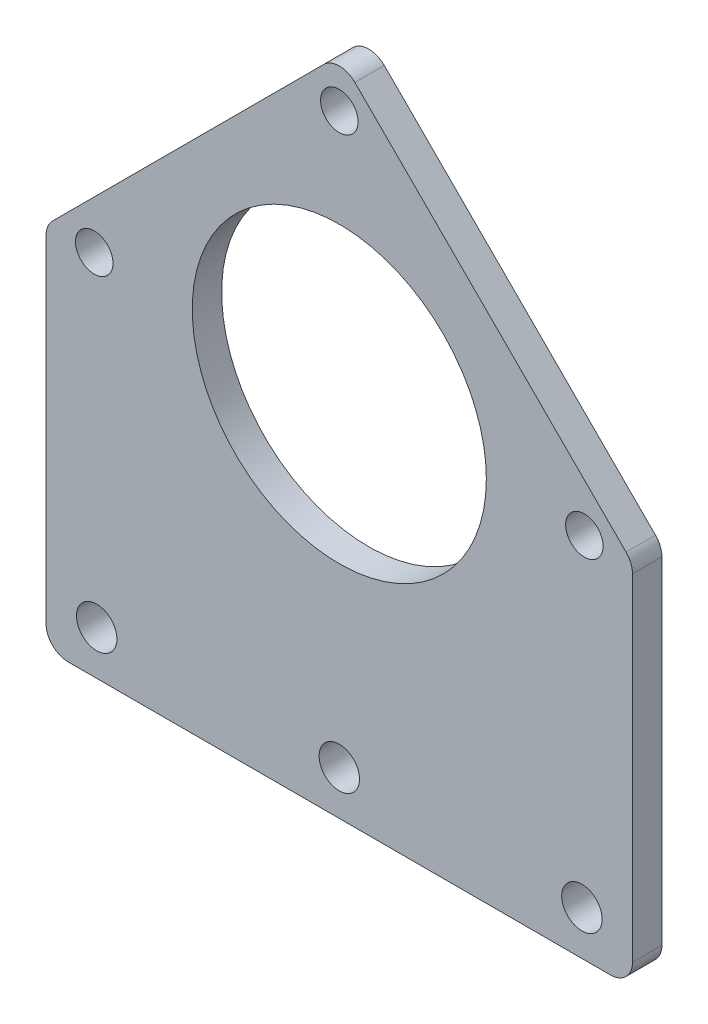
ISO-10303-21;
HEADER;
FILE_DESCRIPTION(('STEP AP214'),'2;1');
FILE_NAME('part.step','',(''),(''),'','','');
FILE_SCHEMA(('AUTOMOTIVE_DESIGN { 1 0 10303 214 1 1 1 1 }'));
ENDSEC;
DATA;
#1=APPLICATION_CONTEXT('core data for automotive mechanical design processes');
#2=APPLICATION_PROTOCOL_DEFINITION('international standard','automotive_design',2000,#1);
#3=PRODUCT_CONTEXT('',#1,'mechanical');
#4=PRODUCT('Part','Part','',(#3));
#5=PRODUCT_RELATED_PRODUCT_CATEGORY('part','',(#4));
#6=PRODUCT_DEFINITION_FORMATION('','',#4);
#7=PRODUCT_DEFINITION_CONTEXT('part definition',#1,'design');
#8=PRODUCT_DEFINITION('design','',#6,#7);
#9=PRODUCT_DEFINITION_SHAPE('','',#8);
#10=(LENGTH_UNIT() NAMED_UNIT(*) SI_UNIT(.MILLI.,.METRE.));
#11=(NAMED_UNIT(*) PLANE_ANGLE_UNIT() SI_UNIT($,.RADIAN.));
#12=(NAMED_UNIT(*) SI_UNIT($,.STERADIAN.) SOLID_ANGLE_UNIT());
#13=UNCERTAINTY_MEASURE_WITH_UNIT(LENGTH_MEASURE(1.E-05),#10,'distance_accuracy_value','');
#14=(GEOMETRIC_REPRESENTATION_CONTEXT(3) GLOBAL_UNCERTAINTY_ASSIGNED_CONTEXT((#13)) GLOBAL_UNIT_ASSIGNED_CONTEXT((#10,
#11,#12)) REPRESENTATION_CONTEXT('',''));
#15=CARTESIAN_POINT('',(0.,0.,0.));
#16=DIRECTION('',(0.,0.,1.));
#17=DIRECTION('',(1.,0.,0.));
#18=AXIS2_PLACEMENT_3D('',#15,#16,#17);
#19=CARTESIAN_POINT('',(0.,0.,4.));
#20=DIRECTION('',(0.,0.,1.));
#21=DIRECTION('',(1.,0.,0.));
#22=AXIS2_PLACEMENT_3D('',#19,#20,#21);
#23=PLANE('',#22);
#24=CARTESIAN_POINT('',(33.3330136651338,0.,4.));
#25=DIRECTION('',(0.,0.,1.));
#26=DIRECTION('',(1.,0.,0.));
#27=AXIS2_PLACEMENT_3D('',#24,#25,#26);
#28=CIRCLE('',#27,2.55);
#29=CARTESIAN_POINT('',(35.8830136651338,0.,4.));
#30=VERTEX_POINT('',#29);
#31=EDGE_CURVE('E236',#30,#30,#28,.T.);
#32=ORIENTED_EDGE('',*,*,#31,.F.);
#33=EDGE_LOOP('',(#32));
#34=FACE_BOUND('',#33,.T.);
#35=CARTESIAN_POINT('',(33.,-44.,4.));
#36=DIRECTION('',(0.,0.,1.));
#37=DIRECTION('',(1.,0.,0.));
#38=AXIS2_PLACEMENT_3D('',#35,#36,#37);
#39=CIRCLE('',#38,2.75);
#40=CARTESIAN_POINT('',(35.75,-44.,4.));
#41=VERTEX_POINT('',#40);
#42=EDGE_CURVE('E224',#41,#41,#39,.T.);
#43=ORIENTED_EDGE('',*,*,#42,.F.);
#44=EDGE_LOOP('',(#43));
#45=FACE_BOUND('',#44,.T.);
#46=CARTESIAN_POINT('',(0.,-44.,4.));
#47=DIRECTION('',(0.,0.,1.));
#48=DIRECTION('',(1.,0.,0.));
#49=AXIS2_PLACEMENT_3D('',#46,#47,#48);
#50=CIRCLE('',#49,2.75);
#51=CARTESIAN_POINT('',(2.75,-44.,4.));
#52=VERTEX_POINT('',#51);
#53=EDGE_CURVE('E213',#52,#52,#50,.T.);
#54=ORIENTED_EDGE('',*,*,#53,.F.);
#55=EDGE_LOOP('',(#54));
#56=FACE_BOUND('',#55,.T.);
#57=DIRECTION('',(1.,0.,0.));
#58=VECTOR('',#57,1.);
#59=CARTESIAN_POINT('',(-39.8808224589212,-50.,4.));
#60=LINE('',#59,#58);
#61=CARTESIAN_POINT('',(-36.8808224589212,-50.,4.));
#62=VERTEX_POINT('',#61);
#63=CARTESIAN_POINT('',(36.8808224589212,-50.,4.));
#64=VERTEX_POINT('',#63);
#65=EDGE_CURVE('E197',#62,#64,#60,.T.);
#66=ORIENTED_EDGE('',*,*,#65,.T.);
#67=CARTESIAN_POINT('',(36.8808224589212,-47.,4.));
#68=DIRECTION('',(0.,0.,1.));
#69=DIRECTION('',(1.,0.,0.));
#70=AXIS2_PLACEMENT_3D('',#67,#68,#69);
#71=CIRCLE('',#70,3.);
#72=CARTESIAN_POINT('',(39.8808224589212,-47.,4.));
#73=VERTEX_POINT('',#72);
#74=EDGE_CURVE('E169',#64,#73,#71,.T.);
#75=ORIENTED_EDGE('',*,*,#74,.T.);
#76=DIRECTION('',(0.,1.,0.));
#77=VECTOR('',#76,1.);
#78=CARTESIAN_POINT('',(39.8808224589212,-50.,4.));
#79=LINE('',#78,#77);
#80=CARTESIAN_POINT('',(39.8808224589212,-1.2426406871193,4.));
#81=VERTEX_POINT('',#80);
#82=EDGE_CURVE('E132',#73,#81,#79,.T.);
#83=ORIENTED_EDGE('',*,*,#82,.T.);
#84=CARTESIAN_POINT('',(36.8808224589212,-1.2426406871193,4.));
#85=DIRECTION('',(0.,0.,1.));
#86=DIRECTION('',(1.,0.,0.));
#87=AXIS2_PLACEMENT_3D('',#84,#85,#86);
#88=CIRCLE('',#87,3.);
#89=CARTESIAN_POINT('',(39.0021428024809,0.878679656440326,4.));
#90=VERTEX_POINT('',#89);
#91=EDGE_CURVE('E165',#81,#90,#88,.T.);
#92=ORIENTED_EDGE('',*,*,#91,.T.);
#93=DIRECTION('',(-0.707106781186546,0.707106781186549,0.));
#94=VECTOR('',#93,1.);
#95=CARTESIAN_POINT('',(0.,39.8808224589213,4.));
#96=LINE('',#95,#94);
#97=CARTESIAN_POINT('',(2.12132034355964,37.7595021153617,4.));
#98=VERTEX_POINT('',#97);
#99=EDGE_CURVE('E206',#90,#98,#96,.T.);
#100=ORIENTED_EDGE('',*,*,#99,.T.);
#101=CARTESIAN_POINT('',(0.,35.638181771802,4.));
#102=DIRECTION('',(0.,0.,1.));
#103=DIRECTION('',(1.,0.,0.));
#104=AXIS2_PLACEMENT_3D('',#101,#102,#103);
#105=CIRCLE('',#104,3.);
#106=CARTESIAN_POINT('',(-2.12132034355965,37.7595021153617,4.));
#107=VERTEX_POINT('',#106);
#108=EDGE_CURVE('E55',#98,#107,#105,.T.);
#109=ORIENTED_EDGE('',*,*,#108,.T.);
#110=DIRECTION('',(-0.707106781186546,-0.707106781186549,0.));
#111=VECTOR('',#110,1.);
#112=CARTESIAN_POINT('',(-39.8808224589212,0.,4.));
#113=LINE('',#112,#111);
#114=CARTESIAN_POINT('',(-39.0021428024809,0.878679656440357,4.));
#115=VERTEX_POINT('',#114);
#116=EDGE_CURVE('E152',#107,#115,#113,.T.);
#117=ORIENTED_EDGE('',*,*,#116,.T.);
#118=CARTESIAN_POINT('',(-36.8808224589212,-1.24264068711928,4.));
#119=DIRECTION('',(0.,0.,1.));
#120=DIRECTION('',(1.,0.,0.));
#121=AXIS2_PLACEMENT_3D('',#118,#119,#120);
#122=CIRCLE('',#121,3.);
#123=CARTESIAN_POINT('',(-39.8808224589212,-1.24264068711928,4.));
#124=VERTEX_POINT('',#123);
#125=EDGE_CURVE('E163',#115,#124,#122,.T.);
#126=ORIENTED_EDGE('',*,*,#125,.T.);
#127=DIRECTION('',(0.,-1.,0.));
#128=VECTOR('',#127,1.);
#129=CARTESIAN_POINT('',(-39.8808224589212,0.,4.));
#130=LINE('',#129,#128);
#131=CARTESIAN_POINT('',(-39.8808224589212,-47.,4.));
#132=VERTEX_POINT('',#131);
#133=EDGE_CURVE('E151',#124,#132,#130,.T.);
#134=ORIENTED_EDGE('',*,*,#133,.T.);
#135=CARTESIAN_POINT('',(-36.8808224589212,-47.,4.));
#136=DIRECTION('',(0.,0.,1.));
#137=DIRECTION('',(1.,0.,0.));
#138=AXIS2_PLACEMENT_3D('',#135,#136,#137);
#139=CIRCLE('',#138,3.);
#140=EDGE_CURVE('E167',#132,#62,#139,.T.);
#141=ORIENTED_EDGE('',*,*,#140,.T.);
#142=EDGE_LOOP('',(#66,#75,#83,#92,#100,#109,#117,#126,#134,#141));
#143=FACE_BOUND('',#142,.T.);
#144=CARTESIAN_POINT('',(-33.,-44.,4.));
#145=DIRECTION('',(0.,0.,1.));
#146=DIRECTION('',(1.,0.,0.));
#147=AXIS2_PLACEMENT_3D('',#144,#145,#146);
#148=CIRCLE('',#147,2.75);
#149=CARTESIAN_POINT('',(-30.25,-44.,4.));
#150=VERTEX_POINT('',#149);
#151=EDGE_CURVE('E208',#150,#150,#148,.T.);
#152=ORIENTED_EDGE('',*,*,#151,.F.);
#153=EDGE_LOOP('',(#152));
#154=FACE_BOUND('',#153,.T.);
#155=CARTESIAN_POINT('',(-33.3330136651338,0.,4.));
#156=DIRECTION('',(0.,0.,1.));
#157=DIRECTION('',(1.,0.,0.));
#158=AXIS2_PLACEMENT_3D('',#155,#156,#157);
#159=CIRCLE('',#158,2.55);
#160=CARTESIAN_POINT('',(-30.7830136651338,0.,4.));
#161=VERTEX_POINT('',#160);
#162=EDGE_CURVE('E218',#161,#161,#159,.T.);
#163=ORIENTED_EDGE('',*,*,#162,.F.);
#164=EDGE_LOOP('',(#163));
#165=FACE_BOUND('',#164,.T.);
#166=CARTESIAN_POINT('',(0.,33.3330136651338,4.));
#167=DIRECTION('',(0.,0.,1.));
#168=DIRECTION('',(1.,0.,0.));
#169=AXIS2_PLACEMENT_3D('',#166,#167,#168);
#170=CIRCLE('',#169,2.55);
#171=CARTESIAN_POINT('',(2.55,33.3330136651338,4.));
#172=VERTEX_POINT('',#171);
#173=EDGE_CURVE('E230',#172,#172,#170,.T.);
#174=ORIENTED_EDGE('',*,*,#173,.F.);
#175=EDGE_LOOP('',(#174));
#176=FACE_BOUND('',#175,.T.);
#177=CARTESIAN_POINT('',(0.,0.,4.));
#178=DIRECTION('',(0.,0.,1.));
#179=DIRECTION('',(1.,0.,0.));
#180=AXIS2_PLACEMENT_3D('',#177,#178,#179);
#181=CIRCLE('',#180,20.);
#182=CARTESIAN_POINT('',(20.,0.,4.));
#183=VERTEX_POINT('',#182);
#184=EDGE_CURVE('E242',#183,#183,#181,.T.);
#185=ORIENTED_EDGE('',*,*,#184,.F.);
#186=EDGE_LOOP('',(#185));
#187=FACE_BOUND('',#186,.T.);
#188=ADVANCED_FACE('F35',(#34,#45,#56,#143,#154,#165,#176,#187),#23,.T.);
#189=CARTESIAN_POINT('',(0.,0.,0.));
#190=DIRECTION('',(0.,0.,1.));
#191=DIRECTION('',(1.,0.,0.));
#192=AXIS2_PLACEMENT_3D('',#189,#190,#191);
#193=PLANE('',#192);
#194=DIRECTION('',(0.,1.,0.));
#195=VECTOR('',#194,1.);
#196=CARTESIAN_POINT('',(39.8808224589212,-50.,0.));
#197=LINE('',#196,#195);
#198=CARTESIAN_POINT('',(39.8808224589212,-47.,0.));
#199=VERTEX_POINT('',#198);
#200=CARTESIAN_POINT('',(39.8808224589212,-1.2426406871193,0.));
#201=VERTEX_POINT('',#200);
#202=EDGE_CURVE('E129',#199,#201,#197,.T.);
#203=ORIENTED_EDGE('',*,*,#202,.F.);
#204=CARTESIAN_POINT('',(36.8808224589212,-47.,0.));
#205=DIRECTION('',(0.,0.,1.));
#206=DIRECTION('',(1.,0.,0.));
#207=AXIS2_PLACEMENT_3D('',#204,#205,#206);
#208=CIRCLE('',#207,3.);
#209=CARTESIAN_POINT('',(36.8808224589212,-50.,0.));
#210=VERTEX_POINT('',#209);
#211=EDGE_CURVE('E112',#199,#210,#208,.F.);
#212=ORIENTED_EDGE('',*,*,#211,.T.);
#213=DIRECTION('',(1.,0.,0.));
#214=VECTOR('',#213,1.);
#215=CARTESIAN_POINT('',(-39.8808224589212,-50.,0.));
#216=LINE('',#215,#214);
#217=CARTESIAN_POINT('',(-36.8808224589212,-50.,0.));
#218=VERTEX_POINT('',#217);
#219=EDGE_CURVE('E141',#218,#210,#216,.T.);
#220=ORIENTED_EDGE('',*,*,#219,.F.);
#221=CARTESIAN_POINT('',(-36.8808224589212,-47.,0.));
#222=DIRECTION('',(0.,0.,1.));
#223=DIRECTION('',(1.,0.,0.));
#224=AXIS2_PLACEMENT_3D('',#221,#222,#223);
#225=CIRCLE('',#224,3.);
#226=CARTESIAN_POINT('',(-39.8808224589212,-47.,0.));
#227=VERTEX_POINT('',#226);
#228=EDGE_CURVE('E123',#218,#227,#225,.F.);
#229=ORIENTED_EDGE('',*,*,#228,.T.);
#230=DIRECTION('',(0.,-1.,0.));
#231=VECTOR('',#230,1.);
#232=CARTESIAN_POINT('',(-39.8808224589212,0.,0.));
#233=LINE('',#232,#231);
#234=CARTESIAN_POINT('',(-39.8808224589212,-1.24264068711928,0.));
#235=VERTEX_POINT('',#234);
#236=EDGE_CURVE('E146',#235,#227,#233,.T.);
#237=ORIENTED_EDGE('',*,*,#236,.F.);
#238=CARTESIAN_POINT('',(-36.8808224589212,-1.24264068711928,0.));
#239=DIRECTION('',(0.,0.,1.));
#240=DIRECTION('',(1.,0.,0.));
#241=AXIS2_PLACEMENT_3D('',#238,#239,#240);
#242=CIRCLE('',#241,3.);
#243=CARTESIAN_POINT('',(-39.0021428024809,0.878679656440357,0.));
#244=VERTEX_POINT('',#243);
#245=EDGE_CURVE('E155',#235,#244,#242,.F.);
#246=ORIENTED_EDGE('',*,*,#245,.T.);
#247=DIRECTION('',(-0.707106781186546,-0.707106781186549,0.));
#248=VECTOR('',#247,1.);
#249=CARTESIAN_POINT('',(-39.8808224589212,0.,0.));
#250=LINE('',#249,#248);
#251=CARTESIAN_POINT('',(-2.12132034355965,37.7595021153617,0.));
#252=VERTEX_POINT('',#251);
#253=EDGE_CURVE('E144',#252,#244,#250,.T.);
#254=ORIENTED_EDGE('',*,*,#253,.F.);
#255=CARTESIAN_POINT('',(0.,35.638181771802,0.));
#256=DIRECTION('',(0.,0.,1.));
#257=DIRECTION('',(1.,0.,0.));
#258=AXIS2_PLACEMENT_3D('',#255,#256,#257);
#259=CIRCLE('',#258,3.);
#260=CARTESIAN_POINT('',(2.12132034355964,37.7595021153617,0.));
#261=VERTEX_POINT('',#260);
#262=EDGE_CURVE('E133',#252,#261,#259,.F.);
#263=ORIENTED_EDGE('',*,*,#262,.T.);
#264=DIRECTION('',(-0.707106781186546,0.707106781186549,0.));
#265=VECTOR('',#264,1.);
#266=CARTESIAN_POINT('',(0.,39.8808224589213,0.));
#267=LINE('',#266,#265);
#268=CARTESIAN_POINT('',(39.0021428024809,0.878679656440326,0.));
#269=VERTEX_POINT('',#268);
#270=EDGE_CURVE('E140',#269,#261,#267,.T.);
#271=ORIENTED_EDGE('',*,*,#270,.F.);
#272=CARTESIAN_POINT('',(36.8808224589212,-1.2426406871193,0.));
#273=DIRECTION('',(0.,0.,1.));
#274=DIRECTION('',(1.,0.,0.));
#275=AXIS2_PLACEMENT_3D('',#272,#273,#274);
#276=CIRCLE('',#275,3.);
#277=EDGE_CURVE('E139',#269,#201,#276,.F.);
#278=ORIENTED_EDGE('',*,*,#277,.T.);
#279=EDGE_LOOP('',(#203,#212,#220,#229,#237,#246,#254,#263,#271,#278));
#280=FACE_BOUND('',#279,.T.);
#281=CARTESIAN_POINT('',(-33.,-44.,0.));
#282=DIRECTION('',(0.,0.,1.));
#283=DIRECTION('',(1.,0.,0.));
#284=AXIS2_PLACEMENT_3D('',#281,#282,#283);
#285=CIRCLE('',#284,2.75);
#286=CARTESIAN_POINT('',(-30.25,-44.,0.));
#287=VERTEX_POINT('',#286);
#288=EDGE_CURVE('E202',#287,#287,#285,.T.);
#289=ORIENTED_EDGE('',*,*,#288,.T.);
#290=EDGE_LOOP('',(#289));
#291=FACE_BOUND('',#290,.T.);
#292=CARTESIAN_POINT('',(0.,-44.,0.));
#293=DIRECTION('',(0.,0.,1.));
#294=DIRECTION('',(1.,0.,0.));
#295=AXIS2_PLACEMENT_3D('',#292,#293,#294);
#296=CIRCLE('',#295,2.75);
#297=CARTESIAN_POINT('',(2.75,-44.,0.));
#298=VERTEX_POINT('',#297);
#299=EDGE_CURVE('E215',#298,#298,#296,.T.);
#300=ORIENTED_EDGE('',*,*,#299,.T.);
#301=EDGE_LOOP('',(#300));
#302=FACE_BOUND('',#301,.T.);
#303=CARTESIAN_POINT('',(-33.3330136651338,0.,0.));
#304=DIRECTION('',(0.,0.,1.));
#305=DIRECTION('',(1.,0.,0.));
#306=AXIS2_PLACEMENT_3D('',#303,#304,#305);
#307=CIRCLE('',#306,2.55);
#308=CARTESIAN_POINT('',(-30.7830136651338,0.,0.));
#309=VERTEX_POINT('',#308);
#310=EDGE_CURVE('E221',#309,#309,#307,.T.);
#311=ORIENTED_EDGE('',*,*,#310,.T.);
#312=EDGE_LOOP('',(#311));
#313=FACE_BOUND('',#312,.T.);
#314=CARTESIAN_POINT('',(33.,-44.,0.));
#315=DIRECTION('',(0.,0.,1.));
#316=DIRECTION('',(1.,0.,0.));
#317=AXIS2_PLACEMENT_3D('',#314,#315,#316);
#318=CIRCLE('',#317,2.75);
#319=CARTESIAN_POINT('',(35.75,-44.,0.));
#320=VERTEX_POINT('',#319);
#321=EDGE_CURVE('E227',#320,#320,#318,.T.);
#322=ORIENTED_EDGE('',*,*,#321,.T.);
#323=EDGE_LOOP('',(#322));
#324=FACE_BOUND('',#323,.T.);
#325=CARTESIAN_POINT('',(0.,33.3330136651338,0.));
#326=DIRECTION('',(0.,0.,1.));
#327=DIRECTION('',(1.,0.,0.));
#328=AXIS2_PLACEMENT_3D('',#325,#326,#327);
#329=CIRCLE('',#328,2.55);
#330=CARTESIAN_POINT('',(2.55,33.3330136651338,0.));
#331=VERTEX_POINT('',#330);
#332=EDGE_CURVE('E233',#331,#331,#329,.T.);
#333=ORIENTED_EDGE('',*,*,#332,.T.);
#334=EDGE_LOOP('',(#333));
#335=FACE_BOUND('',#334,.T.);
#336=CARTESIAN_POINT('',(33.3330136651338,0.,0.));
#337=DIRECTION('',(0.,0.,1.));
#338=DIRECTION('',(1.,0.,0.));
#339=AXIS2_PLACEMENT_3D('',#336,#337,#338);
#340=CIRCLE('',#339,2.55);
#341=CARTESIAN_POINT('',(35.8830136651338,0.,0.));
#342=VERTEX_POINT('',#341);
#343=EDGE_CURVE('E239',#342,#342,#340,.T.);
#344=ORIENTED_EDGE('',*,*,#343,.T.);
#345=EDGE_LOOP('',(#344));
#346=FACE_BOUND('',#345,.T.);
#347=CARTESIAN_POINT('',(0.,0.,0.));
#348=DIRECTION('',(0.,0.,1.));
#349=DIRECTION('',(1.,0.,0.));
#350=AXIS2_PLACEMENT_3D('',#347,#348,#349);
#351=CIRCLE('',#350,20.);
#352=CARTESIAN_POINT('',(20.,0.,0.));
#353=VERTEX_POINT('',#352);
#354=EDGE_CURVE('E245',#353,#353,#351,.T.);
#355=ORIENTED_EDGE('',*,*,#354,.T.);
#356=EDGE_LOOP('',(#355));
#357=FACE_BOUND('',#356,.T.);
#358=ADVANCED_FACE('F136',(#280,#291,#302,#313,#324,#335,#346,#357),#193,.F.);
#359=CARTESIAN_POINT('',(-39.8808224589212,0.,4.));
#360=DIRECTION('',(1.,0.,0.));
#361=DIRECTION('',(0.,1.,0.));
#362=AXIS2_PLACEMENT_3D('',#359,#360,#361);
#363=PLANE('',#362);
#364=ORIENTED_EDGE('',*,*,#236,.T.);
#365=DIRECTION('',(0.,0.,-1.));
#366=VECTOR('',#365,1.);
#367=CARTESIAN_POINT('',(-39.8808224589212,-47.,4.));
#368=LINE('',#367,#366);
#369=EDGE_CURVE('E174',#227,#132,#368,.F.);
#370=ORIENTED_EDGE('',*,*,#369,.T.);
#371=ORIENTED_EDGE('',*,*,#133,.F.);
#372=DIRECTION('',(0.,0.,-1.));
#373=VECTOR('',#372,1.);
#374=CARTESIAN_POINT('',(-39.8808224589212,-1.24264068711928,4.));
#375=LINE('',#374,#373);
#376=EDGE_CURVE('E171',#124,#235,#375,.T.);
#377=ORIENTED_EDGE('',*,*,#376,.T.);
#378=EDGE_LOOP('',(#364,#370,#371,#377));
#379=FACE_BOUND('',#378,.T.);
#380=ADVANCED_FACE('F193',(#379),#363,.F.);
#381=CARTESIAN_POINT('',(-39.8808224589212,-50.,4.));
#382=DIRECTION('',(0.,1.,0.));
#383=DIRECTION('',(0.,0.,1.));
#384=AXIS2_PLACEMENT_3D('',#381,#382,#383);
#385=PLANE('',#384);
#386=ORIENTED_EDGE('',*,*,#219,.T.);
#387=DIRECTION('',(0.,0.,-1.));
#388=VECTOR('',#387,1.);
#389=CARTESIAN_POINT('',(36.8808224589212,-50.,4.));
#390=LINE('',#389,#388);
#391=EDGE_CURVE('E117',#210,#64,#390,.F.);
#392=ORIENTED_EDGE('',*,*,#391,.T.);
#393=ORIENTED_EDGE('',*,*,#65,.F.);
#394=DIRECTION('',(0.,0.,-1.));
#395=VECTOR('',#394,1.);
#396=CARTESIAN_POINT('',(-36.8808224589212,-50.,4.));
#397=LINE('',#396,#395);
#398=EDGE_CURVE('E122',#62,#218,#397,.T.);
#399=ORIENTED_EDGE('',*,*,#398,.T.);
#400=EDGE_LOOP('',(#386,#392,#393,#399));
#401=FACE_BOUND('',#400,.T.);
#402=ADVANCED_FACE('F275',(#401),#385,.F.);
#403=CARTESIAN_POINT('',(39.8808224589212,-50.,4.));
#404=DIRECTION('',(-1.,0.,0.));
#405=DIRECTION('',(0.,0.,1.));
#406=AXIS2_PLACEMENT_3D('',#403,#404,#405);
#407=PLANE('',#406);
#408=ORIENTED_EDGE('',*,*,#82,.F.);
#409=DIRECTION('',(0.,0.,-1.));
#410=VECTOR('',#409,1.);
#411=CARTESIAN_POINT('',(39.8808224589212,-47.,4.));
#412=LINE('',#411,#410);
#413=EDGE_CURVE('E116',#73,#199,#412,.T.);
#414=ORIENTED_EDGE('',*,*,#413,.T.);
#415=ORIENTED_EDGE('',*,*,#202,.T.);
#416=DIRECTION('',(0.,0.,-1.));
#417=VECTOR('',#416,1.);
#418=CARTESIAN_POINT('',(39.8808224589212,-1.2426406871193,4.));
#419=LINE('',#418,#417);
#420=EDGE_CURVE('E134',#201,#81,#419,.F.);
#421=ORIENTED_EDGE('',*,*,#420,.T.);
#422=EDGE_LOOP('',(#408,#414,#415,#421));
#423=FACE_BOUND('',#422,.T.);
#424=ADVANCED_FACE('F128',(#423),#407,.F.);
#425=CARTESIAN_POINT('',(0.,39.8808224589213,4.));
#426=DIRECTION('',(-0.707106781186549,-0.707106781186546,0.));
#427=DIRECTION('',(0.707106781186546,-0.707106781186549,0.));
#428=AXIS2_PLACEMENT_3D('',#425,#426,#427);
#429=PLANE('',#428);
#430=ORIENTED_EDGE('',*,*,#99,.F.);
#431=DIRECTION('',(0.,0.,-1.));
#432=VECTOR('',#431,1.);
#433=CARTESIAN_POINT('',(39.0021428024809,0.87867965644034,4.));
#434=LINE('',#433,#432);
#435=EDGE_CURVE('E178',#90,#269,#434,.T.);
#436=ORIENTED_EDGE('',*,*,#435,.T.);
#437=ORIENTED_EDGE('',*,*,#270,.T.);
#438=DIRECTION('',(0.,0.,-1.));
#439=VECTOR('',#438,1.);
#440=CARTESIAN_POINT('',(2.12132034355964,37.7595021153617,4.));
#441=LINE('',#440,#439);
#442=EDGE_CURVE('E176',#261,#98,#441,.F.);
#443=ORIENTED_EDGE('',*,*,#442,.T.);
#444=EDGE_LOOP('',(#430,#436,#437,#443));
#445=FACE_BOUND('',#444,.T.);
#446=ADVANCED_FACE('F269',(#445),#429,.F.);
#447=CARTESIAN_POINT('',(-39.8808224589212,0.,4.));
#448=DIRECTION('',(0.707106781186549,-0.707106781186546,0.));
#449=DIRECTION('',(0.707106781186546,0.707106781186549,0.));
#450=AXIS2_PLACEMENT_3D('',#447,#448,#449);
#451=PLANE('',#450);
#452=ORIENTED_EDGE('',*,*,#253,.T.);
#453=DIRECTION('',(0.,0.,-1.));
#454=VECTOR('',#453,1.);
#455=CARTESIAN_POINT('',(-39.0021428024809,0.878679656440357,4.));
#456=LINE('',#455,#454);
#457=EDGE_CURVE('E11',#244,#115,#456,.F.);
#458=ORIENTED_EDGE('',*,*,#457,.T.);
#459=ORIENTED_EDGE('',*,*,#116,.F.);
#460=DIRECTION('',(0.,0.,-1.));
#461=VECTOR('',#460,1.);
#462=CARTESIAN_POINT('',(-2.12132034355965,37.7595021153617,4.));
#463=LINE('',#462,#461);
#464=EDGE_CURVE('E43',#107,#252,#463,.T.);
#465=ORIENTED_EDGE('',*,*,#464,.T.);
#466=EDGE_LOOP('',(#452,#458,#459,#465));
#467=FACE_BOUND('',#466,.T.);
#468=ADVANCED_FACE('F183',(#467),#451,.F.);
#469=CARTESIAN_POINT('',(-33.,-44.,4.));
#470=DIRECTION('',(0.,0.,-1.));
#471=DIRECTION('',(-1.,0.,0.));
#472=AXIS2_PLACEMENT_3D('',#469,#470,#471);
#473=CYLINDRICAL_SURFACE('',#472,2.75);
#474=ORIENTED_EDGE('',*,*,#151,.T.);
#475=EDGE_LOOP('',(#474));
#476=FACE_BOUND('',#475,.T.);
#477=ORIENTED_EDGE('',*,*,#288,.F.);
#478=EDGE_LOOP('',(#477));
#479=FACE_BOUND('',#478,.T.);
#480=ADVANCED_FACE('F264',(#476,#479),#473,.F.);
#481=CARTESIAN_POINT('',(0.,-44.,4.));
#482=DIRECTION('',(0.,0.,-1.));
#483=DIRECTION('',(-1.,0.,0.));
#484=AXIS2_PLACEMENT_3D('',#481,#482,#483);
#485=CYLINDRICAL_SURFACE('',#484,2.75);
#486=ORIENTED_EDGE('',*,*,#53,.T.);
#487=EDGE_LOOP('',(#486));
#488=FACE_BOUND('',#487,.T.);
#489=ORIENTED_EDGE('',*,*,#299,.F.);
#490=EDGE_LOOP('',(#489));
#491=FACE_BOUND('',#490,.T.);
#492=ADVANCED_FACE('F333',(#488,#491),#485,.F.);
#493=CARTESIAN_POINT('',(-33.3330136651338,0.,4.));
#494=DIRECTION('',(0.,0.,-1.));
#495=DIRECTION('',(-1.,0.,0.));
#496=AXIS2_PLACEMENT_3D('',#493,#494,#495);
#497=CYLINDRICAL_SURFACE('',#496,2.55);
#498=ORIENTED_EDGE('',*,*,#162,.T.);
#499=EDGE_LOOP('',(#498));
#500=FACE_BOUND('',#499,.T.);
#501=ORIENTED_EDGE('',*,*,#310,.F.);
#502=EDGE_LOOP('',(#501));
#503=FACE_BOUND('',#502,.T.);
#504=ADVANCED_FACE('F330',(#500,#503),#497,.F.);
#505=CARTESIAN_POINT('',(33.,-44.,4.));
#506=DIRECTION('',(0.,0.,-1.));
#507=DIRECTION('',(-1.,0.,0.));
#508=AXIS2_PLACEMENT_3D('',#505,#506,#507);
#509=CYLINDRICAL_SURFACE('',#508,2.75);
#510=ORIENTED_EDGE('',*,*,#42,.T.);
#511=EDGE_LOOP('',(#510));
#512=FACE_BOUND('',#511,.T.);
#513=ORIENTED_EDGE('',*,*,#321,.F.);
#514=EDGE_LOOP('',(#513));
#515=FACE_BOUND('',#514,.T.);
#516=ADVANCED_FACE('F312',(#512,#515),#509,.F.);
#517=CARTESIAN_POINT('',(0.,33.3330136651338,4.));
#518=DIRECTION('',(0.,0.,-1.));
#519=DIRECTION('',(-1.,0.,0.));
#520=AXIS2_PLACEMENT_3D('',#517,#518,#519);
#521=CYLINDRICAL_SURFACE('',#520,2.55);
#522=ORIENTED_EDGE('',*,*,#173,.T.);
#523=EDGE_LOOP('',(#522));
#524=FACE_BOUND('',#523,.T.);
#525=ORIENTED_EDGE('',*,*,#332,.F.);
#526=EDGE_LOOP('',(#525));
#527=FACE_BOUND('',#526,.T.);
#528=ADVANCED_FACE('F308',(#524,#527),#521,.F.);
#529=CARTESIAN_POINT('',(33.3330136651338,0.,4.));
#530=DIRECTION('',(0.,0.,-1.));
#531=DIRECTION('',(-1.,0.,0.));
#532=AXIS2_PLACEMENT_3D('',#529,#530,#531);
#533=CYLINDRICAL_SURFACE('',#532,2.55);
#534=ORIENTED_EDGE('',*,*,#31,.T.);
#535=EDGE_LOOP('',(#534));
#536=FACE_BOUND('',#535,.T.);
#537=ORIENTED_EDGE('',*,*,#343,.F.);
#538=EDGE_LOOP('',(#537));
#539=FACE_BOUND('',#538,.T.);
#540=ADVANCED_FACE('F311',(#536,#539),#533,.F.);
#541=CARTESIAN_POINT('',(0.,0.,4.));
#542=DIRECTION('',(0.,0.,-1.));
#543=DIRECTION('',(-1.,0.,0.));
#544=AXIS2_PLACEMENT_3D('',#541,#542,#543);
#545=CYLINDRICAL_SURFACE('',#544,20.);
#546=ORIENTED_EDGE('',*,*,#184,.T.);
#547=EDGE_LOOP('',(#546));
#548=FACE_BOUND('',#547,.T.);
#549=ORIENTED_EDGE('',*,*,#354,.F.);
#550=EDGE_LOOP('',(#549));
#551=FACE_BOUND('',#550,.T.);
#552=ADVANCED_FACE('F251',(#548,#551),#545,.F.);
#553=CARTESIAN_POINT('',(36.8808224589212,-47.,4.));
#554=DIRECTION('',(0.,0.,-1.));
#555=DIRECTION('',(-1.,0.,0.));
#556=AXIS2_PLACEMENT_3D('',#553,#554,#555);
#557=CYLINDRICAL_SURFACE('',#556,3.);
#558=ORIENTED_EDGE('',*,*,#74,.F.);
#559=ORIENTED_EDGE('',*,*,#391,.F.);
#560=ORIENTED_EDGE('',*,*,#211,.F.);
#561=ORIENTED_EDGE('',*,*,#413,.F.);
#562=EDGE_LOOP('',(#558,#559,#560,#561));
#563=FACE_BOUND('',#562,.T.);
#564=ADVANCED_FACE('F115',(#563),#557,.T.);
#565=CARTESIAN_POINT('',(-36.8808224589212,-47.,4.));
#566=DIRECTION('',(0.,0.,-1.));
#567=DIRECTION('',(-1.,0.,0.));
#568=AXIS2_PLACEMENT_3D('',#565,#566,#567);
#569=CYLINDRICAL_SURFACE('',#568,3.);
#570=ORIENTED_EDGE('',*,*,#140,.F.);
#571=ORIENTED_EDGE('',*,*,#369,.F.);
#572=ORIENTED_EDGE('',*,*,#228,.F.);
#573=ORIENTED_EDGE('',*,*,#398,.F.);
#574=EDGE_LOOP('',(#570,#571,#572,#573));
#575=FACE_BOUND('',#574,.T.);
#576=ADVANCED_FACE('F283',(#575),#569,.T.);
#577=CARTESIAN_POINT('',(36.8808224589212,-1.2426406871193,4.));
#578=DIRECTION('',(0.,0.,-1.));
#579=DIRECTION('',(-1.,0.,0.));
#580=AXIS2_PLACEMENT_3D('',#577,#578,#579);
#581=CYLINDRICAL_SURFACE('',#580,3.);
#582=ORIENTED_EDGE('',*,*,#91,.F.);
#583=ORIENTED_EDGE('',*,*,#420,.F.);
#584=ORIENTED_EDGE('',*,*,#277,.F.);
#585=ORIENTED_EDGE('',*,*,#435,.F.);
#586=EDGE_LOOP('',(#582,#583,#584,#585));
#587=FACE_BOUND('',#586,.T.);
#588=ADVANCED_FACE('F286',(#587),#581,.T.);
#589=CARTESIAN_POINT('',(-36.8808224589212,-1.24264068711928,4.));
#590=DIRECTION('',(0.,0.,-1.));
#591=DIRECTION('',(-1.,0.,0.));
#592=AXIS2_PLACEMENT_3D('',#589,#590,#591);
#593=CYLINDRICAL_SURFACE('',#592,3.);
#594=ORIENTED_EDGE('',*,*,#125,.F.);
#595=ORIENTED_EDGE('',*,*,#457,.F.);
#596=ORIENTED_EDGE('',*,*,#245,.F.);
#597=ORIENTED_EDGE('',*,*,#376,.F.);
#598=EDGE_LOOP('',(#594,#595,#596,#597));
#599=FACE_BOUND('',#598,.T.);
#600=ADVANCED_FACE('F190',(#599),#593,.T.);
#601=CARTESIAN_POINT('',(0.,35.638181771802,4.));
#602=DIRECTION('',(0.,0.,-1.));
#603=DIRECTION('',(-1.,0.,0.));
#604=AXIS2_PLACEMENT_3D('',#601,#602,#603);
#605=CYLINDRICAL_SURFACE('',#604,3.);
#606=ORIENTED_EDGE('',*,*,#108,.F.);
#607=ORIENTED_EDGE('',*,*,#442,.F.);
#608=ORIENTED_EDGE('',*,*,#262,.F.);
#609=ORIENTED_EDGE('',*,*,#464,.F.);
#610=EDGE_LOOP('',(#606,#607,#608,#609));
#611=FACE_BOUND('',#610,.T.);
#612=ADVANCED_FACE('F37',(#611),#605,.T.);
#613=CLOSED_SHELL('',(#188,#358,#380,#402,#424,#446,#468,#480,#492,#504,#516,#528,#540,#552,
#564,#576,#588,#600,#612));
#614=MANIFOLD_SOLID_BREP('B2',#613);
#615=ADVANCED_BREP_SHAPE_REPRESENTATION('',(#18,#614),#14);
#616=SHAPE_DEFINITION_REPRESENTATION(#9,#615);
ENDSEC;
END-ISO-10303-21;
